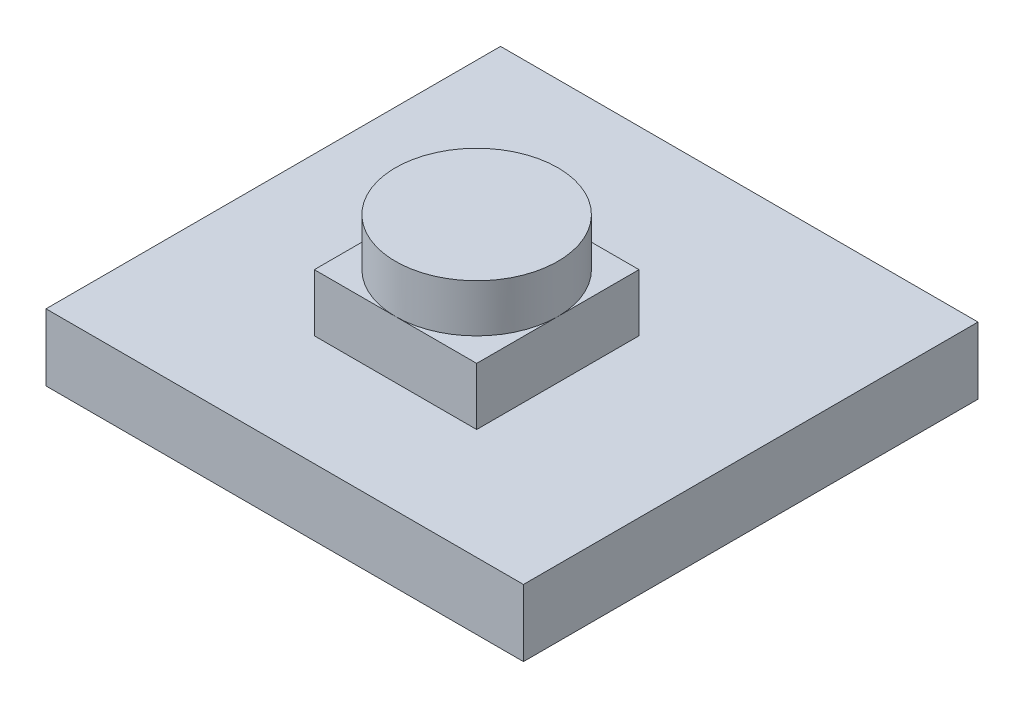
ISO-10303-21;
HEADER;
FILE_DESCRIPTION(('STEP AP214'),'2;1');
FILE_NAME('part.step','',(''),(''),'','','');
FILE_SCHEMA(('AUTOMOTIVE_DESIGN { 1 0 10303 214 1 1 1 1 }'));
ENDSEC;
DATA;
#1=APPLICATION_CONTEXT('core data for automotive mechanical design processes');
#2=APPLICATION_PROTOCOL_DEFINITION('international standard','automotive_design',2000,#1);
#3=PRODUCT_CONTEXT('',#1,'mechanical');
#4=PRODUCT('Part','Part','',(#3));
#5=PRODUCT_RELATED_PRODUCT_CATEGORY('part','',(#4));
#6=PRODUCT_DEFINITION_FORMATION('','',#4);
#7=PRODUCT_DEFINITION_CONTEXT('part definition',#1,'design');
#8=PRODUCT_DEFINITION('design','',#6,#7);
#9=PRODUCT_DEFINITION_SHAPE('','',#8);
#10=(LENGTH_UNIT() NAMED_UNIT(*) SI_UNIT(.MILLI.,.METRE.));
#11=(NAMED_UNIT(*) PLANE_ANGLE_UNIT() SI_UNIT($,.RADIAN.));
#12=(NAMED_UNIT(*) SI_UNIT($,.STERADIAN.) SOLID_ANGLE_UNIT());
#13=UNCERTAINTY_MEASURE_WITH_UNIT(LENGTH_MEASURE(1.E-05),#10,'distance_accuracy_value','');
#14=(GEOMETRIC_REPRESENTATION_CONTEXT(3) GLOBAL_UNCERTAINTY_ASSIGNED_CONTEXT((#13)) GLOBAL_UNIT_ASSIGNED_CONTEXT((#10,
#11,#12)) REPRESENTATION_CONTEXT('',''));
#15=CARTESIAN_POINT('',(0.,0.,0.));
#16=DIRECTION('',(0.,0.,1.));
#17=DIRECTION('',(1.,0.,0.));
#18=AXIS2_PLACEMENT_3D('',#15,#16,#17);
#19=CARTESIAN_POINT('',(0.,6.5,0.));
#20=DIRECTION('',(0.,-1.,0.));
#21=DIRECTION('',(0.,0.,-1.));
#22=AXIS2_PLACEMENT_3D('',#19,#20,#21);
#23=PLANE('',#22);
#24=DIRECTION('',(1.,0.,0.));
#25=VECTOR('',#24,1.);
#26=CARTESIAN_POINT('',(0.,6.5,-2.4));
#27=LINE('',#26,#25);
#28=CARTESIAN_POINT('',(0.,6.5,-2.4));
#29=VERTEX_POINT('',#28);
#30=CARTESIAN_POINT('',(4.25,6.5,-2.4));
#31=VERTEX_POINT('',#30);
#32=EDGE_CURVE('E138',#29,#31,#27,.T.);
#33=ORIENTED_EDGE('',*,*,#32,.F.);
#34=CARTESIAN_POINT('',(0.,6.5,1.85));
#35=DIRECTION('',(0.,-1.,0.));
#36=DIRECTION('',(0.,0.,-1.));
#37=AXIS2_PLACEMENT_3D('',#34,#35,#36);
#38=CIRCLE('',#37,4.25);
#39=CARTESIAN_POINT('',(4.25,6.5,1.85));
#40=VERTEX_POINT('',#39);
#41=EDGE_CURVE('E11',#29,#40,#38,.T.);
#42=ORIENTED_EDGE('',*,*,#41,.T.);
#43=DIRECTION('',(0.,0.,1.));
#44=VECTOR('',#43,1.);
#45=CARTESIAN_POINT('',(4.25,6.5,0.));
#46=LINE('',#45,#44);
#47=EDGE_CURVE('E143',#31,#40,#46,.T.);
#48=ORIENTED_EDGE('',*,*,#47,.F.);
#49=EDGE_LOOP('',(#33,#42,#48));
#50=FACE_BOUND('',#49,.T.);
#51=ADVANCED_FACE('F34',(#50),#23,.F.);
#52=CARTESIAN_POINT('',(4.25,6.5,6.1));
#53=VERTEX_POINT('',#52);
#54=EDGE_CURVE('E142',#40,#53,#46,.T.);
#55=ORIENTED_EDGE('',*,*,#54,.F.);
#56=CARTESIAN_POINT('',(0.,6.5,6.1));
#57=VERTEX_POINT('',#56);
#58=EDGE_CURVE('E43',#40,#57,#38,.T.);
#59=ORIENTED_EDGE('',*,*,#58,.T.);
#60=DIRECTION('',(-1.,0.,0.));
#61=VECTOR('',#60,1.);
#62=CARTESIAN_POINT('',(0.,6.5,6.1));
#63=LINE('',#62,#61);
#64=EDGE_CURVE('E146',#53,#57,#63,.T.);
#65=ORIENTED_EDGE('',*,*,#64,.F.);
#66=EDGE_LOOP('',(#55,#59,#65));
#67=FACE_BOUND('',#66,.T.);
#68=ADVANCED_FACE('F221',(#67),#23,.F.);
#69=CARTESIAN_POINT('',(-4.25,6.5,6.1));
#70=VERTEX_POINT('',#69);
#71=EDGE_CURVE('E122',#57,#70,#63,.T.);
#72=ORIENTED_EDGE('',*,*,#71,.F.);
#73=CARTESIAN_POINT('',(-4.25,6.5,1.85));
#74=VERTEX_POINT('',#73);
#75=EDGE_CURVE('E109',#57,#74,#38,.T.);
#76=ORIENTED_EDGE('',*,*,#75,.T.);
#77=DIRECTION('',(0.,0.,-1.));
#78=VECTOR('',#77,1.);
#79=CARTESIAN_POINT('',(-4.25,6.5,0.));
#80=LINE('',#79,#78);
#81=EDGE_CURVE('E121',#70,#74,#80,.T.);
#82=ORIENTED_EDGE('',*,*,#81,.F.);
#83=EDGE_LOOP('',(#72,#76,#82));
#84=FACE_BOUND('',#83,.T.);
#85=ADVANCED_FACE('F119',(#84),#23,.F.);
#86=CARTESIAN_POINT('',(12.5,3.5,11.9));
#87=DIRECTION('',(-1.,0.,0.));
#88=DIRECTION('',(0.,0.,1.));
#89=AXIS2_PLACEMENT_3D('',#86,#87,#88);
#90=PLANE('',#89);
#91=DIRECTION('',(0.,0.,-1.));
#92=VECTOR('',#91,1.);
#93=CARTESIAN_POINT('',(12.5,0.,11.9));
#94=LINE('',#93,#92);
#95=CARTESIAN_POINT('',(12.5,0.,11.9));
#96=VERTEX_POINT('',#95);
#97=CARTESIAN_POINT('',(12.5,0.,-11.9));
#98=VERTEX_POINT('',#97);
#99=EDGE_CURVE('E163',#96,#98,#94,.T.);
#100=ORIENTED_EDGE('',*,*,#99,.T.);
#101=DIRECTION('',(0.,-1.,0.));
#102=VECTOR('',#101,1.);
#103=CARTESIAN_POINT('',(12.5,3.5,-11.9));
#104=LINE('',#103,#102);
#105=CARTESIAN_POINT('',(12.5,3.5,-11.9));
#106=VERTEX_POINT('',#105);
#107=EDGE_CURVE('E115',#106,#98,#104,.T.);
#108=ORIENTED_EDGE('',*,*,#107,.F.);
#109=DIRECTION('',(0.,0.,-1.));
#110=VECTOR('',#109,1.);
#111=CARTESIAN_POINT('',(12.5,3.5,11.9));
#112=LINE('',#111,#110);
#113=CARTESIAN_POINT('',(12.5,3.5,11.9));
#114=VERTEX_POINT('',#113);
#115=EDGE_CURVE('E164',#114,#106,#112,.T.);
#116=ORIENTED_EDGE('',*,*,#115,.F.);
#117=DIRECTION('',(0.,-1.,0.));
#118=VECTOR('',#117,1.);
#119=CARTESIAN_POINT('',(12.5,3.5,11.9));
#120=LINE('',#119,#118);
#121=EDGE_CURVE('E174',#114,#96,#120,.T.);
#122=ORIENTED_EDGE('',*,*,#121,.T.);
#123=EDGE_LOOP('',(#100,#108,#116,#122));
#124=FACE_BOUND('',#123,.T.);
#125=ADVANCED_FACE('F36',(#124),#90,.F.);
#126=CARTESIAN_POINT('',(-12.5,3.5,-11.9));
#127=DIRECTION('',(0.,0.,1.));
#128=DIRECTION('',(1.,0.,0.));
#129=AXIS2_PLACEMENT_3D('',#126,#127,#128);
#130=PLANE('',#129);
#131=DIRECTION('',(-1.,0.,0.));
#132=VECTOR('',#131,1.);
#133=CARTESIAN_POINT('',(-12.5,0.,-11.9));
#134=LINE('',#133,#132);
#135=CARTESIAN_POINT('',(-12.5,0.,-11.9));
#136=VERTEX_POINT('',#135);
#137=EDGE_CURVE('E177',#98,#136,#134,.T.);
#138=ORIENTED_EDGE('',*,*,#137,.T.);
#139=DIRECTION('',(0.,-1.,0.));
#140=VECTOR('',#139,1.);
#141=CARTESIAN_POINT('',(-12.5,3.5,-11.9));
#142=LINE('',#141,#140);
#143=CARTESIAN_POINT('',(-12.5,3.5,-11.9));
#144=VERTEX_POINT('',#143);
#145=EDGE_CURVE('E187',#144,#136,#142,.T.);
#146=ORIENTED_EDGE('',*,*,#145,.F.);
#147=DIRECTION('',(-1.,0.,0.));
#148=VECTOR('',#147,1.);
#149=CARTESIAN_POINT('',(-12.5,3.5,-11.9));
#150=LINE('',#149,#148);
#151=EDGE_CURVE('E167',#106,#144,#150,.T.);
#152=ORIENTED_EDGE('',*,*,#151,.F.);
#153=ORIENTED_EDGE('',*,*,#107,.T.);
#154=EDGE_LOOP('',(#138,#146,#152,#153));
#155=FACE_BOUND('',#154,.T.);
#156=ADVANCED_FACE('F192',(#155),#130,.F.);
#157=CARTESIAN_POINT('',(-12.5,3.5,11.9));
#158=DIRECTION('',(1.,0.,0.));
#159=DIRECTION('',(0.,0.,-1.));
#160=AXIS2_PLACEMENT_3D('',#157,#158,#159);
#161=PLANE('',#160);
#162=DIRECTION('',(0.,0.,1.));
#163=VECTOR('',#162,1.);
#164=CARTESIAN_POINT('',(-12.5,0.,11.9));
#165=LINE('',#164,#163);
#166=CARTESIAN_POINT('',(-12.5,0.,11.9));
#167=VERTEX_POINT('',#166);
#168=EDGE_CURVE('E179',#136,#167,#165,.T.);
#169=ORIENTED_EDGE('',*,*,#168,.T.);
#170=DIRECTION('',(0.,-1.,0.));
#171=VECTOR('',#170,1.);
#172=CARTESIAN_POINT('',(-12.5,3.5,11.9));
#173=LINE('',#172,#171);
#174=CARTESIAN_POINT('',(-12.5,3.5,11.9));
#175=VERTEX_POINT('',#174);
#176=EDGE_CURVE('E184',#175,#167,#173,.T.);
#177=ORIENTED_EDGE('',*,*,#176,.F.);
#178=DIRECTION('',(0.,0.,1.));
#179=VECTOR('',#178,1.);
#180=CARTESIAN_POINT('',(-12.5,3.5,11.9));
#181=LINE('',#180,#179);
#182=EDGE_CURVE('E170',#144,#175,#181,.T.);
#183=ORIENTED_EDGE('',*,*,#182,.F.);
#184=ORIENTED_EDGE('',*,*,#145,.T.);
#185=EDGE_LOOP('',(#169,#177,#183,#184));
#186=FACE_BOUND('',#185,.T.);
#187=ADVANCED_FACE('F204',(#186),#161,.F.);
#188=CARTESIAN_POINT('',(-12.5,3.5,11.9));
#189=DIRECTION('',(0.,0.,-1.));
#190=DIRECTION('',(-1.,0.,0.));
#191=AXIS2_PLACEMENT_3D('',#188,#189,#190);
#192=PLANE('',#191);
#193=DIRECTION('',(1.,0.,0.));
#194=VECTOR('',#193,1.);
#195=CARTESIAN_POINT('',(-12.5,0.,11.9));
#196=LINE('',#195,#194);
#197=EDGE_CURVE('E168',#167,#96,#196,.T.);
#198=ORIENTED_EDGE('',*,*,#197,.T.);
#199=ORIENTED_EDGE('',*,*,#121,.F.);
#200=DIRECTION('',(1.,0.,0.));
#201=VECTOR('',#200,1.);
#202=CARTESIAN_POINT('',(-12.5,3.5,11.9));
#203=LINE('',#202,#201);
#204=EDGE_CURVE('E172',#175,#114,#203,.T.);
#205=ORIENTED_EDGE('',*,*,#204,.F.);
#206=ORIENTED_EDGE('',*,*,#176,.T.);
#207=EDGE_LOOP('',(#198,#199,#205,#206));
#208=FACE_BOUND('',#207,.T.);
#209=ADVANCED_FACE('F208',(#208),#192,.F.);
#210=CARTESIAN_POINT('',(0.,3.5,0.));
#211=DIRECTION('',(0.,-1.,0.));
#212=DIRECTION('',(0.,0.,-1.));
#213=AXIS2_PLACEMENT_3D('',#210,#211,#212);
#214=PLANE('',#213);
#215=DIRECTION('',(-1.,0.,0.));
#216=VECTOR('',#215,1.);
#217=CARTESIAN_POINT('',(0.,3.5,6.1));
#218=LINE('',#217,#216);
#219=CARTESIAN_POINT('',(4.25,3.5,6.1));
#220=VERTEX_POINT('',#219);
#221=CARTESIAN_POINT('',(-4.25,3.5,6.1));
#222=VERTEX_POINT('',#221);
#223=EDGE_CURVE('E159',#220,#222,#218,.T.);
#224=ORIENTED_EDGE('',*,*,#223,.T.);
#225=DIRECTION('',(0.,0.,-1.));
#226=VECTOR('',#225,1.);
#227=CARTESIAN_POINT('',(-4.25,3.5,0.));
#228=LINE('',#227,#226);
#229=CARTESIAN_POINT('',(-4.25,3.5,-2.4));
#230=VERTEX_POINT('',#229);
#231=EDGE_CURVE('E161',#222,#230,#228,.T.);
#232=ORIENTED_EDGE('',*,*,#231,.T.);
#233=DIRECTION('',(1.,0.,0.));
#234=VECTOR('',#233,1.);
#235=CARTESIAN_POINT('',(0.,3.5,-2.4));
#236=LINE('',#235,#234);
#237=CARTESIAN_POINT('',(4.25,3.5,-2.4));
#238=VERTEX_POINT('',#237);
#239=EDGE_CURVE('E56',#230,#238,#236,.T.);
#240=ORIENTED_EDGE('',*,*,#239,.T.);
#241=DIRECTION('',(0.,0.,1.));
#242=VECTOR('',#241,1.);
#243=CARTESIAN_POINT('',(4.25,3.5,0.));
#244=LINE('',#243,#242);
#245=EDGE_CURVE('E157',#238,#220,#244,.T.);
#246=ORIENTED_EDGE('',*,*,#245,.T.);
#247=EDGE_LOOP('',(#224,#232,#240,#246));
#248=FACE_BOUND('',#247,.T.);
#249=ORIENTED_EDGE('',*,*,#115,.T.);
#250=ORIENTED_EDGE('',*,*,#151,.T.);
#251=ORIENTED_EDGE('',*,*,#182,.T.);
#252=ORIENTED_EDGE('',*,*,#204,.T.);
#253=EDGE_LOOP('',(#249,#250,#251,#252));
#254=FACE_BOUND('',#253,.T.);
#255=ADVANCED_FACE('F210',(#248,#254),#214,.F.);
#256=CARTESIAN_POINT('',(0.,0.,0.));
#257=DIRECTION('',(0.,-1.,0.));
#258=DIRECTION('',(0.,0.,-1.));
#259=AXIS2_PLACEMENT_3D('',#256,#257,#258);
#260=PLANE('',#259);
#261=ORIENTED_EDGE('',*,*,#99,.F.);
#262=ORIENTED_EDGE('',*,*,#197,.F.);
#263=ORIENTED_EDGE('',*,*,#168,.F.);
#264=ORIENTED_EDGE('',*,*,#137,.F.);
#265=EDGE_LOOP('',(#261,#262,#263,#264));
#266=FACE_BOUND('',#265,.T.);
#267=ADVANCED_FACE('F200',(#266),#260,.T.);
#268=CARTESIAN_POINT('',(-4.25,6.5,0.));
#269=DIRECTION('',(-1.,0.,0.));
#270=DIRECTION('',(0.,0.,1.));
#271=AXIS2_PLACEMENT_3D('',#268,#269,#270);
#272=PLANE('',#271);
#273=DIRECTION('',(0.,-1.,0.));
#274=VECTOR('',#273,1.);
#275=CARTESIAN_POINT('',(-4.25,6.5,-2.4));
#276=LINE('',#275,#274);
#277=CARTESIAN_POINT('',(-4.25,6.5,-2.4));
#278=VERTEX_POINT('',#277);
#279=EDGE_CURVE('E148',#278,#230,#276,.T.);
#280=ORIENTED_EDGE('',*,*,#279,.T.);
#281=ORIENTED_EDGE('',*,*,#231,.F.);
#282=DIRECTION('',(0.,-1.,0.));
#283=VECTOR('',#282,1.);
#284=CARTESIAN_POINT('',(-4.25,6.5,6.1));
#285=LINE('',#284,#283);
#286=EDGE_CURVE('E137',#70,#222,#285,.T.);
#287=ORIENTED_EDGE('',*,*,#286,.F.);
#288=ORIENTED_EDGE('',*,*,#81,.T.);
#289=EDGE_CURVE('E124',#74,#278,#80,.T.);
#290=ORIENTED_EDGE('',*,*,#289,.T.);
#291=EDGE_LOOP('',(#280,#281,#287,#288,#290));
#292=FACE_BOUND('',#291,.T.);
#293=ADVANCED_FACE('F134',(#292),#272,.T.);
#294=CARTESIAN_POINT('',(0.,6.5,6.1));
#295=DIRECTION('',(0.,0.,1.));
#296=DIRECTION('',(1.,0.,0.));
#297=AXIS2_PLACEMENT_3D('',#294,#295,#296);
#298=PLANE('',#297);
#299=ORIENTED_EDGE('',*,*,#286,.T.);
#300=ORIENTED_EDGE('',*,*,#223,.F.);
#301=DIRECTION('',(0.,-1.,0.));
#302=VECTOR('',#301,1.);
#303=CARTESIAN_POINT('',(4.25,6.5,6.1));
#304=LINE('',#303,#302);
#305=EDGE_CURVE('E150',#53,#220,#304,.T.);
#306=ORIENTED_EDGE('',*,*,#305,.F.);
#307=ORIENTED_EDGE('',*,*,#64,.T.);
#308=ORIENTED_EDGE('',*,*,#71,.T.);
#309=EDGE_LOOP('',(#299,#300,#306,#307,#308));
#310=FACE_BOUND('',#309,.T.);
#311=ADVANCED_FACE('F293',(#310),#298,.T.);
#312=CARTESIAN_POINT('',(4.25,6.5,0.));
#313=DIRECTION('',(1.,0.,0.));
#314=DIRECTION('',(0.,0.,-1.));
#315=AXIS2_PLACEMENT_3D('',#312,#313,#314);
#316=PLANE('',#315);
#317=ORIENTED_EDGE('',*,*,#305,.T.);
#318=ORIENTED_EDGE('',*,*,#245,.F.);
#319=DIRECTION('',(0.,-1.,0.));
#320=VECTOR('',#319,1.);
#321=CARTESIAN_POINT('',(4.25,6.5,-2.4));
#322=LINE('',#321,#320);
#323=EDGE_CURVE('E153',#31,#238,#322,.T.);
#324=ORIENTED_EDGE('',*,*,#323,.F.);
#325=ORIENTED_EDGE('',*,*,#47,.T.);
#326=ORIENTED_EDGE('',*,*,#54,.T.);
#327=EDGE_LOOP('',(#317,#318,#324,#325,#326));
#328=FACE_BOUND('',#327,.T.);
#329=ADVANCED_FACE('F238',(#328),#316,.T.);
#330=CARTESIAN_POINT('',(0.,6.5,-2.4));
#331=DIRECTION('',(0.,0.,-1.));
#332=DIRECTION('',(-1.,0.,0.));
#333=AXIS2_PLACEMENT_3D('',#330,#331,#332);
#334=PLANE('',#333);
#335=ORIENTED_EDGE('',*,*,#323,.T.);
#336=ORIENTED_EDGE('',*,*,#239,.F.);
#337=ORIENTED_EDGE('',*,*,#279,.F.);
#338=EDGE_CURVE('E127',#278,#29,#27,.T.);
#339=ORIENTED_EDGE('',*,*,#338,.T.);
#340=ORIENTED_EDGE('',*,*,#32,.T.);
#341=EDGE_LOOP('',(#335,#336,#337,#339,#340));
#342=FACE_BOUND('',#341,.T.);
#343=ADVANCED_FACE('F231',(#342),#334,.T.);
#344=ORIENTED_EDGE('',*,*,#289,.F.);
#345=EDGE_CURVE('E38',#74,#29,#38,.T.);
#346=ORIENTED_EDGE('',*,*,#345,.T.);
#347=ORIENTED_EDGE('',*,*,#338,.F.);
#348=EDGE_LOOP('',(#344,#346,#347));
#349=FACE_BOUND('',#348,.T.);
#350=ADVANCED_FACE('F125',(#349),#23,.F.);
#351=CARTESIAN_POINT('',(0.,9.,1.85));
#352=DIRECTION('',(0.,-1.,0.));
#353=DIRECTION('',(0.,0.,-1.));
#354=AXIS2_PLACEMENT_3D('',#351,#352,#353);
#355=CYLINDRICAL_SURFACE('',#354,4.25);
#356=CARTESIAN_POINT('',(0.,9.,1.85));
#357=DIRECTION('',(0.,-1.,0.));
#358=DIRECTION('',(0.,0.,-1.));
#359=AXIS2_PLACEMENT_3D('',#356,#357,#358);
#360=CIRCLE('',#359,4.25);
#361=CARTESIAN_POINT('',(0.,9.,-2.4));
#362=VERTEX_POINT('',#361);
#363=EDGE_CURVE('E131',#362,#362,#360,.T.);
#364=ORIENTED_EDGE('',*,*,#363,.T.);
#365=EDGE_LOOP('',(#364));
#366=FACE_BOUND('',#365,.T.);
#367=ORIENTED_EDGE('',*,*,#41,.F.);
#368=ORIENTED_EDGE('',*,*,#345,.F.);
#369=ORIENTED_EDGE('',*,*,#75,.F.);
#370=ORIENTED_EDGE('',*,*,#58,.F.);
#371=EDGE_LOOP('',(#367,#368,#369,#370));
#372=FACE_BOUND('',#371,.T.);
#373=ADVANCED_FACE('F108',(#366,#372),#355,.T.);
#374=CARTESIAN_POINT('',(0.,9.,1.85));
#375=DIRECTION('',(0.,-1.,0.));
#376=DIRECTION('',(0.,0.,-1.));
#377=AXIS2_PLACEMENT_3D('',#374,#375,#376);
#378=PLANE('',#377);
#379=ORIENTED_EDGE('',*,*,#363,.F.);
#380=EDGE_LOOP('',(#379));
#381=FACE_BOUND('',#380,.T.);
#382=ADVANCED_FACE('F236',(#381),#378,.F.);
#383=CLOSED_SHELL('',(#51,#68,#85,#125,#156,#187,#209,#255,#267,#293,#311,#329,#343,#350,#373,#382));
#384=MANIFOLD_SOLID_BREP('B2',#383);
#385=ADVANCED_BREP_SHAPE_REPRESENTATION('',(#18,#384),#14);
#386=SHAPE_DEFINITION_REPRESENTATION(#9,#385);
ENDSEC;
END-ISO-10303-21;
